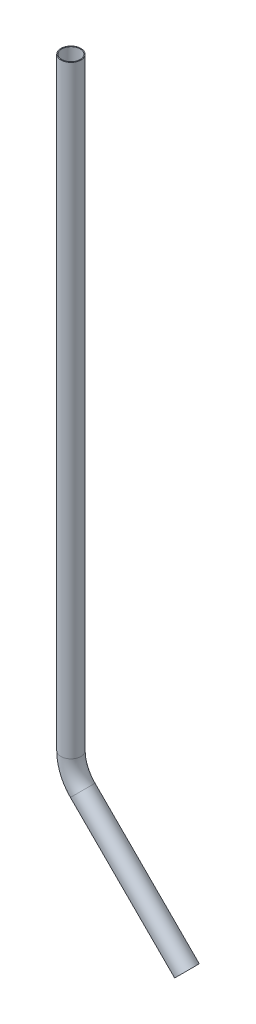
ISO-10303-21;
HEADER;
FILE_DESCRIPTION(('STEP AP214'),'2;1');
FILE_NAME('part.step','',(''),(''),'','','');
FILE_SCHEMA(('AUTOMOTIVE_DESIGN { 1 0 10303 214 1 1 1 1 }'));
ENDSEC;
DATA;
#1=APPLICATION_CONTEXT('core data for automotive mechanical design processes');
#2=APPLICATION_PROTOCOL_DEFINITION('international standard','automotive_design',2000,#1);
#3=PRODUCT_CONTEXT('',#1,'mechanical');
#4=PRODUCT('Part','Part','',(#3));
#5=PRODUCT_RELATED_PRODUCT_CATEGORY('part','',(#4));
#6=PRODUCT_DEFINITION_FORMATION('','',#4);
#7=PRODUCT_DEFINITION_CONTEXT('part definition',#1,'design');
#8=PRODUCT_DEFINITION('design','',#6,#7);
#9=PRODUCT_DEFINITION_SHAPE('','',#8);
#10=(LENGTH_UNIT() NAMED_UNIT(*) SI_UNIT(.MILLI.,.METRE.));
#11=(NAMED_UNIT(*) PLANE_ANGLE_UNIT() SI_UNIT($,.RADIAN.));
#12=(NAMED_UNIT(*) SI_UNIT($,.STERADIAN.) SOLID_ANGLE_UNIT());
#13=UNCERTAINTY_MEASURE_WITH_UNIT(LENGTH_MEASURE(1.E-05),#10,'distance_accuracy_value','');
#14=(GEOMETRIC_REPRESENTATION_CONTEXT(3) GLOBAL_UNCERTAINTY_ASSIGNED_CONTEXT((#13)) GLOBAL_UNIT_ASSIGNED_CONTEXT((#10,
#11,#12)) REPRESENTATION_CONTEXT('',''));
#15=CARTESIAN_POINT('',(0.,0.,0.));
#16=DIRECTION('',(0.,0.,1.));
#17=DIRECTION('',(1.,0.,0.));
#18=AXIS2_PLACEMENT_3D('',#15,#16,#17);
#19=CARTESIAN_POINT('',(-111.76,524.143486726415,0.));
#20=DIRECTION('',(0.,-1.,0.));
#21=DIRECTION('',(1.,0.,0.));
#22=AXIS2_PLACEMENT_3D('',#19,#20,#21);
#23=CYLINDRICAL_SURFACE('',#22,9.52500000000001);
#24=CARTESIAN_POINT('',(-111.76,-47.3565132735846,0.));
#25=DIRECTION('',(0.,1.,0.));
#26=DIRECTION('',(0.,0.,1.));
#27=AXIS2_PLACEMENT_3D('',#24,#25,#26);
#28=CIRCLE('',#27,9.52500000000001);
#29=CARTESIAN_POINT('',(-121.285,-47.3565132735846,0.));
#30=VERTEX_POINT('',#29);
#31=EDGE_CURVE('E56',#30,#30,#28,.T.);
#32=ORIENTED_EDGE('',*,*,#31,.T.);
#33=EDGE_LOOP('',(#32));
#34=FACE_BOUND('',#33,.T.);
#35=CARTESIAN_POINT('',(-111.76,524.143486726415,0.));
#36=DIRECTION('',(0.,1.,0.));
#37=DIRECTION('',(0.,0.,1.));
#38=AXIS2_PLACEMENT_3D('',#35,#36,#37);
#39=CIRCLE('',#38,9.52500000000001);
#40=CARTESIAN_POINT('',(-111.76,524.143486726415,9.52500000000001));
#41=VERTEX_POINT('',#40);
#42=EDGE_CURVE('E54',#41,#41,#39,.T.);
#43=ORIENTED_EDGE('',*,*,#42,.F.);
#44=EDGE_LOOP('',(#43));
#45=FACE_BOUND('',#44,.T.);
#46=ADVANCED_FACE('F33',(#34,#45),#23,.T.);
#47=CARTESIAN_POINT('',(-73.66,-47.3565132735846,0.));
#48=DIRECTION('',(0.,0.,1.));
#49=DIRECTION('',(1.,0.,0.));
#50=AXIS2_PLACEMENT_3D('',#47,#48,#49);
#51=TOROIDAL_SURFACE('',#50,38.1,9.52500000000001);
#52=CARTESIAN_POINT('',(-100.600768363208,-74.297281636792,0.));
#53=DIRECTION('',(-0.707106781186546,0.707106781186549,0.));
#54=DIRECTION('',(0.,0.,1.));
#55=AXIS2_PLACEMENT_3D('',#52,#53,#54);
#56=CIRCLE('',#55,9.52500000000001);
#57=CARTESIAN_POINT('',(-107.335960454009,-81.0324737275938,0.));
#58=VERTEX_POINT('',#57);
#59=EDGE_CURVE('E37',#58,#58,#56,.T.);
#60=CARTESIAN_POINT('',(-73.66,-47.3565132735846,0.));
#61=DIRECTION('',(0.,0.,1.));
#62=DIRECTION('',(1.,0.,0.));
#63=AXIS2_PLACEMENT_3D('',#60,#61,#62);
#64=CIRCLE('',#63,47.625);
#65=EDGE_CURVE('',#30,#58,#64,.T.);
#66=ORIENTED_EDGE('',*,*,#31,.F.);
#67=ORIENTED_EDGE('',*,*,#59,.T.);
#68=ORIENTED_EDGE('',*,*,#65,.T.);
#69=ORIENTED_EDGE('',*,*,#65,.F.);
#70=EDGE_LOOP('',(#66,#68,#67,#69));
#71=FACE_BOUND('',#70,.T.);
#72=ADVANCED_FACE('F63',(#71),#51,.T.);
#73=CARTESIAN_POINT('',(-100.600768363208,-74.297281636792,0.));
#74=DIRECTION('',(0.707106781186548,-0.707106781186547,0.));
#75=DIRECTION('',(0.707106781186547,0.707106781186548,0.));
#76=AXIS2_PLACEMENT_3D('',#73,#74,#75);
#77=CYLINDRICAL_SURFACE('',#76,9.52500000000001);
#78=CARTESIAN_POINT('',(-1.81795103144683,-173.080098968553,0.));
#79=DIRECTION('',(-0.707106781186548,0.707106781186547,0.));
#80=DIRECTION('',(0.,0.,1.));
#81=AXIS2_PLACEMENT_3D('',#78,#79,#80);
#82=CIRCLE('',#81,9.52500000000001);
#83=CARTESIAN_POINT('',(-1.81795103144683,-173.080098968553,9.52500000000001));
#84=VERTEX_POINT('',#83);
#85=EDGE_CURVE('E50',#84,#84,#82,.T.);
#86=ORIENTED_EDGE('',*,*,#85,.T.);
#87=EDGE_LOOP('',(#86));
#88=FACE_BOUND('',#87,.T.);
#89=ORIENTED_EDGE('',*,*,#59,.F.);
#90=EDGE_LOOP('',(#89));
#91=FACE_BOUND('',#90,.T.);
#92=ADVANCED_FACE('F35',(#88,#91),#77,.T.);
#93=CARTESIAN_POINT('',(-111.76,524.143486726415,0.));
#94=DIRECTION('',(0.,1.,0.));
#95=DIRECTION('',(0.,0.,1.));
#96=AXIS2_PLACEMENT_3D('',#93,#94,#95);
#97=PLANE('',#96);
#98=CARTESIAN_POINT('',(-111.76,524.143486726415,0.));
#99=DIRECTION('',(0.,1.,0.));
#100=DIRECTION('',(0.,0.,1.));
#101=AXIS2_PLACEMENT_3D('',#98,#99,#100);
#102=CIRCLE('',#101,8.7122);
#103=CARTESIAN_POINT('',(-111.76,524.143486726415,8.7122));
#104=VERTEX_POINT('',#103);
#105=EDGE_CURVE('E53',#104,#104,#102,.F.);
#106=ORIENTED_EDGE('',*,*,#105,.T.);
#107=EDGE_LOOP('',(#106));
#108=FACE_BOUND('',#107,.T.);
#109=ORIENTED_EDGE('',*,*,#42,.T.);
#110=EDGE_LOOP('',(#109));
#111=FACE_BOUND('',#110,.T.);
#112=ADVANCED_FACE('F67',(#108,#111),#97,.T.);
#113=CARTESIAN_POINT('',(-1.81795103144683,-173.080098968553,0.));
#114=DIRECTION('',(-0.707106781186548,0.707106781186547,0.));
#115=DIRECTION('',(0.,0.,1.));
#116=AXIS2_PLACEMENT_3D('',#113,#114,#115);
#117=PLANE('',#116);
#118=CARTESIAN_POINT('',(-1.81795103144683,-173.080098968553,0.));
#119=DIRECTION('',(-0.707106781186548,0.707106781186547,0.));
#120=DIRECTION('',(0.,0.,1.));
#121=AXIS2_PLACEMENT_3D('',#118,#119,#120);
#122=CIRCLE('',#121,8.7122);
#123=CARTESIAN_POINT('',(-1.81795103144683,-173.080098968553,8.7122));
#124=VERTEX_POINT('',#123);
#125=EDGE_CURVE('E10',#124,#124,#122,.F.);
#126=ORIENTED_EDGE('',*,*,#125,.F.);
#127=EDGE_LOOP('',(#126));
#128=FACE_BOUND('',#127,.T.);
#129=ORIENTED_EDGE('',*,*,#85,.F.);
#130=EDGE_LOOP('',(#129));
#131=FACE_BOUND('',#130,.T.);
#132=ADVANCED_FACE('F73',(#128,#131),#117,.F.);
#133=CARTESIAN_POINT('',(-111.76,524.143486726415,0.));
#134=DIRECTION('',(0.,-1.,0.));
#135=DIRECTION('',(1.,0.,0.));
#136=AXIS2_PLACEMENT_3D('',#133,#134,#135);
#137=CYLINDRICAL_SURFACE('',#136,8.7122);
#138=CARTESIAN_POINT('',(-111.76,-47.3565132735846,0.));
#139=DIRECTION('',(0.,1.,0.));
#140=DIRECTION('',(0.,0.,1.));
#141=AXIS2_PLACEMENT_3D('',#138,#139,#140);
#142=CIRCLE('',#141,8.7122);
#143=CARTESIAN_POINT('',(-120.4722,-47.3565132735846,0.));
#144=VERTEX_POINT('',#143);
#145=EDGE_CURVE('E46',#144,#144,#142,.F.);
#146=ORIENTED_EDGE('',*,*,#145,.T.);
#147=EDGE_LOOP('',(#146));
#148=FACE_BOUND('',#147,.T.);
#149=ORIENTED_EDGE('',*,*,#105,.F.);
#150=EDGE_LOOP('',(#149));
#151=FACE_BOUND('',#150,.T.);
#152=ADVANCED_FACE('F83',(#148,#151),#137,.F.);
#153=CARTESIAN_POINT('',(-73.66,-47.3565132735846,0.));
#154=DIRECTION('',(0.,0.,1.));
#155=DIRECTION('',(1.,0.,0.));
#156=AXIS2_PLACEMENT_3D('',#153,#154,#155);
#157=TOROIDAL_SURFACE('',#156,38.1,8.7122);
#158=CARTESIAN_POINT('',(-100.600768363208,-74.297281636792,0.));
#159=DIRECTION('',(-0.707106781186546,0.707106781186549,0.));
#160=DIRECTION('',(0.,0.,1.));
#161=AXIS2_PLACEMENT_3D('',#158,#159,#160);
#162=CIRCLE('',#161,8.7122);
#163=CARTESIAN_POINT('',(-106.761224062261,-80.4577373358454,0.));
#164=VERTEX_POINT('',#163);
#165=EDGE_CURVE('E41',#164,#164,#162,.F.);
#166=CARTESIAN_POINT('',(-73.66,-47.3565132735846,0.));
#167=DIRECTION('',(0.,0.,1.));
#168=DIRECTION('',(1.,0.,0.));
#169=AXIS2_PLACEMENT_3D('',#166,#167,#168);
#170=CIRCLE('',#169,46.8122);
#171=EDGE_CURVE('',#144,#164,#170,.T.);
#172=ORIENTED_EDGE('',*,*,#145,.F.);
#173=ORIENTED_EDGE('',*,*,#165,.T.);
#174=ORIENTED_EDGE('',*,*,#171,.T.);
#175=ORIENTED_EDGE('',*,*,#171,.F.);
#176=EDGE_LOOP('',(#172,#174,#173,#175));
#177=FACE_BOUND('',#176,.T.);
#178=ADVANCED_FACE('F78',(#177),#157,.F.);
#179=CARTESIAN_POINT('',(-100.600768363208,-74.297281636792,0.));
#180=DIRECTION('',(0.707106781186548,-0.707106781186547,0.));
#181=DIRECTION('',(0.707106781186547,0.707106781186548,0.));
#182=AXIS2_PLACEMENT_3D('',#179,#180,#181);
#183=CYLINDRICAL_SURFACE('',#182,8.7122);
#184=ORIENTED_EDGE('',*,*,#125,.T.);
#185=EDGE_LOOP('',(#184));
#186=FACE_BOUND('',#185,.T.);
#187=ORIENTED_EDGE('',*,*,#165,.F.);
#188=EDGE_LOOP('',(#187));
#189=FACE_BOUND('',#188,.T.);
#190=ADVANCED_FACE('F76',(#186,#189),#183,.F.);
#191=CLOSED_SHELL('',(#46,#72,#92,#112,#132,#152,#178,#190));
#192=MANIFOLD_SOLID_BREP('B2',#191);
#193=ADVANCED_BREP_SHAPE_REPRESENTATION('',(#18,#192),#14);
#194=SHAPE_DEFINITION_REPRESENTATION(#9,#193);
ENDSEC;
END-ISO-10303-21;
